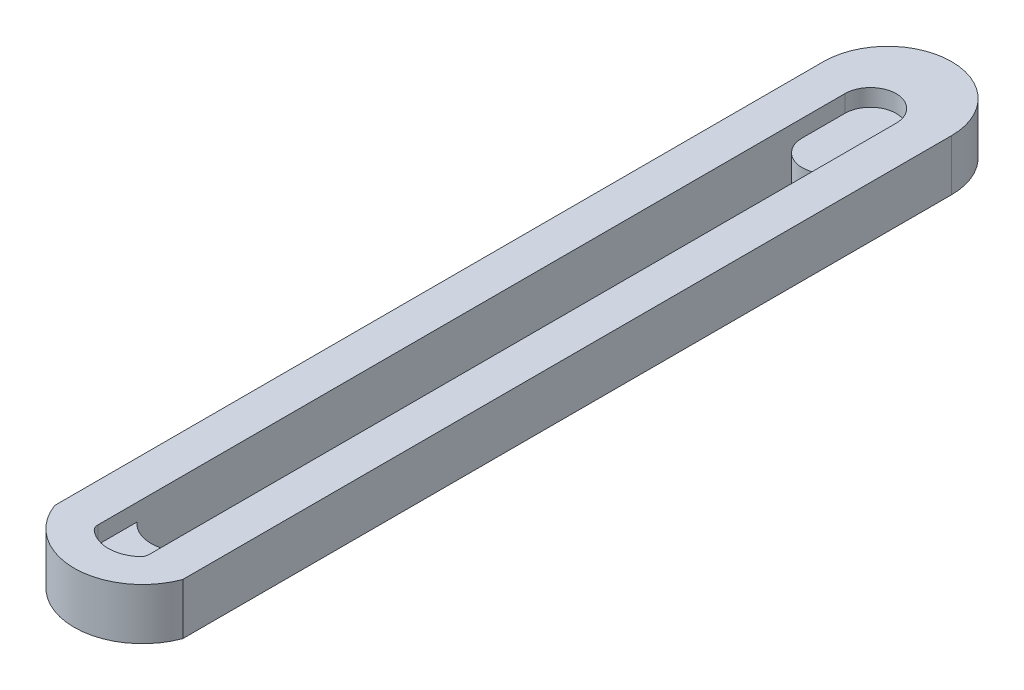
ISO-10303-21;
HEADER;
FILE_DESCRIPTION(('STEP AP214'),'2;1');
FILE_NAME('part.step','',(''),(''),'','','');
FILE_SCHEMA(('AUTOMOTIVE_DESIGN { 1 0 10303 214 1 1 1 1 }'));
ENDSEC;
DATA;
#1=APPLICATION_CONTEXT('core data for automotive mechanical design processes');
#2=APPLICATION_PROTOCOL_DEFINITION('international standard','automotive_design',2000,#1);
#3=PRODUCT_CONTEXT('',#1,'mechanical');
#4=PRODUCT('Part','Part','',(#3));
#5=PRODUCT_RELATED_PRODUCT_CATEGORY('part','',(#4));
#6=PRODUCT_DEFINITION_FORMATION('','',#4);
#7=PRODUCT_DEFINITION_CONTEXT('part definition',#1,'design');
#8=PRODUCT_DEFINITION('design','',#6,#7);
#9=PRODUCT_DEFINITION_SHAPE('','',#8);
#10=(LENGTH_UNIT() NAMED_UNIT(*) SI_UNIT(.MILLI.,.METRE.));
#11=(NAMED_UNIT(*) PLANE_ANGLE_UNIT() SI_UNIT($,.RADIAN.));
#12=(NAMED_UNIT(*) SI_UNIT($,.STERADIAN.) SOLID_ANGLE_UNIT());
#13=UNCERTAINTY_MEASURE_WITH_UNIT(LENGTH_MEASURE(1.E-05),#10,'distance_accuracy_value','');
#14=(GEOMETRIC_REPRESENTATION_CONTEXT(3) GLOBAL_UNCERTAINTY_ASSIGNED_CONTEXT((#13)) GLOBAL_UNIT_ASSIGNED_CONTEXT((#10,
#11,#12)) REPRESENTATION_CONTEXT('',''));
#15=CARTESIAN_POINT('',(0.,0.,0.));
#16=DIRECTION('',(0.,0.,1.));
#17=DIRECTION('',(1.,0.,0.));
#18=AXIS2_PLACEMENT_3D('',#15,#16,#17);
#19=CARTESIAN_POINT('',(0.,0.5,0.));
#20=DIRECTION('',(0.,1.,0.));
#21=DIRECTION('',(0.,0.,1.));
#22=AXIS2_PLACEMENT_3D('',#19,#20,#21);
#23=PLANE('',#22);
#24=CARTESIAN_POINT('',(0.,0.5,-40.1080589092925));
#25=DIRECTION('',(0.,1.,0.));
#26=DIRECTION('',(0.,0.,1.));
#27=AXIS2_PLACEMENT_3D('',#24,#25,#26);
#28=CIRCLE('',#27,1.5);
#29=CARTESIAN_POINT('',(1.5,0.5,-40.1080589092925));
#30=VERTEX_POINT('',#29);
#31=CARTESIAN_POINT('',(-1.5,0.5,-40.1080589092925));
#32=VERTEX_POINT('',#31);
#33=EDGE_CURVE('E11',#30,#32,#28,.F.);
#34=ORIENTED_EDGE('',*,*,#33,.F.);
#35=DIRECTION('',(0.,0.,1.));
#36=VECTOR('',#35,1.);
#37=CARTESIAN_POINT('',(1.5,0.5,0.));
#38=LINE('',#37,#36);
#39=CARTESIAN_POINT('',(1.5,0.5,-42.6080589092925));
#40=VERTEX_POINT('',#39);
#41=EDGE_CURVE('E195',#40,#30,#38,.T.);
#42=ORIENTED_EDGE('',*,*,#41,.F.);
#43=CARTESIAN_POINT('',(0.,0.5,-42.6080589092925));
#44=DIRECTION('',(0.,1.,0.));
#45=DIRECTION('',(0.,0.,1.));
#46=AXIS2_PLACEMENT_3D('',#43,#44,#45);
#47=CIRCLE('',#46,1.5);
#48=CARTESIAN_POINT('',(-1.5,0.5,-42.6080589092925));
#49=VERTEX_POINT('',#48);
#50=EDGE_CURVE('E184',#40,#49,#47,.T.);
#51=ORIENTED_EDGE('',*,*,#50,.T.);
#52=DIRECTION('',(0.,0.,-1.));
#53=VECTOR('',#52,1.);
#54=CARTESIAN_POINT('',(-1.5,0.5,0.));
#55=LINE('',#54,#53);
#56=EDGE_CURVE('E199',#32,#49,#55,.T.);
#57=ORIENTED_EDGE('',*,*,#56,.F.);
#58=EDGE_LOOP('',(#34,#42,#51,#57));
#59=FACE_BOUND('',#58,.T.);
#60=ADVANCED_FACE('F44',(#59),#23,.T.);
#61=CARTESIAN_POINT('',(0.,1.5,-42.6080589092925));
#62=DIRECTION('',(0.,-1.,0.));
#63=DIRECTION('',(0.,0.,-1.));
#64=AXIS2_PLACEMENT_3D('',#61,#62,#63);
#65=CYLINDRICAL_SURFACE('',#64,1.5);
#66=CARTESIAN_POINT('',(0.,-1.5,-42.6080589092925));
#67=DIRECTION('',(0.,1.,0.));
#68=DIRECTION('',(0.,0.,1.));
#69=AXIS2_PLACEMENT_3D('',#66,#67,#68);
#70=CIRCLE('',#69,1.5);
#71=CARTESIAN_POINT('',(0.,-1.5,-41.1080589092925));
#72=VERTEX_POINT('',#71);
#73=EDGE_CURVE('E216',#72,#72,#70,.T.);
#74=ORIENTED_EDGE('',*,*,#73,.F.);
#75=EDGE_LOOP('',(#74));
#76=FACE_BOUND('',#75,.T.);
#77=CARTESIAN_POINT('',(0.,0.,-42.6080589092925));
#78=DIRECTION('',(0.,1.,0.));
#79=DIRECTION('',(0.,0.,1.));
#80=AXIS2_PLACEMENT_3D('',#77,#78,#79);
#81=CIRCLE('',#80,1.5);
#82=CARTESIAN_POINT('',(0.,0.,-41.1080589092925));
#83=VERTEX_POINT('',#82);
#84=EDGE_CURVE('E174',#83,#83,#81,.T.);
#85=ORIENTED_EDGE('',*,*,#84,.T.);
#86=EDGE_LOOP('',(#85));
#87=FACE_BOUND('',#86,.T.);
#88=ADVANCED_FACE('F339',(#76,#87),#65,.F.);
#89=CARTESIAN_POINT('',(0.,1.5,0.));
#90=DIRECTION('',(0.,1.,0.));
#91=DIRECTION('',(0.,0.,1.));
#92=AXIS2_PLACEMENT_3D('',#89,#90,#91);
#93=PLANE('',#92);
#94=CARTESIAN_POINT('',(0.,1.5,0.));
#95=DIRECTION('',(0.,1.,0.));
#96=DIRECTION('',(0.,0.,1.));
#97=AXIS2_PLACEMENT_3D('',#94,#95,#96);
#98=CIRCLE('',#97,4.);
#99=CARTESIAN_POINT('',(-3.75000000000001,1.5,1.39194109070749));
#100=VERTEX_POINT('',#99);
#101=CARTESIAN_POINT('',(3.75000000000001,1.5,1.39194109070749));
#102=VERTEX_POINT('',#101);
#103=EDGE_CURVE('E228',#100,#102,#98,.T.);
#104=ORIENTED_EDGE('',*,*,#103,.T.);
#105=DIRECTION('',(0.,0.,-1.));
#106=VECTOR('',#105,1.);
#107=CARTESIAN_POINT('',(3.75,1.5,-43.6080589092925));
#108=LINE('',#107,#106);
#109=CARTESIAN_POINT('',(3.75,1.5,-43.6080589092925));
#110=VERTEX_POINT('',#109);
#111=EDGE_CURVE('E232',#102,#110,#108,.T.);
#112=ORIENTED_EDGE('',*,*,#111,.T.);
#113=CARTESIAN_POINT('',(0.,1.5,-43.6080589092925));
#114=DIRECTION('',(0.,1.,0.));
#115=DIRECTION('',(0.,0.,-1.));
#116=AXIS2_PLACEMENT_3D('',#113,#114,#115);
#117=CIRCLE('',#116,3.75);
#118=CARTESIAN_POINT('',(-3.75,1.5,-43.6080589092925));
#119=VERTEX_POINT('',#118);
#120=EDGE_CURVE('E236',#110,#119,#117,.T.);
#121=ORIENTED_EDGE('',*,*,#120,.T.);
#122=DIRECTION('',(0.,0.,1.));
#123=VECTOR('',#122,1.);
#124=CARTESIAN_POINT('',(-3.75000000000001,1.5,1.39194109070749));
#125=LINE('',#124,#123);
#126=EDGE_CURVE('E239',#119,#100,#125,.T.);
#127=ORIENTED_EDGE('',*,*,#126,.T.);
#128=EDGE_LOOP('',(#104,#112,#121,#127));
#129=FACE_BOUND('',#128,.T.);
#130=CARTESIAN_POINT('',(0.,1.5,0.));
#131=DIRECTION('',(0.,1.,0.));
#132=DIRECTION('',(0.,0.,1.));
#133=AXIS2_PLACEMENT_3D('',#130,#131,#132);
#134=CIRCLE('',#133,2.);
#135=CARTESIAN_POINT('',(-1.33333333333333,1.5,1.49071198499986));
#136=VERTEX_POINT('',#135);
#137=CARTESIAN_POINT('',(1.33333333333333,1.5,1.49071198499986));
#138=VERTEX_POINT('',#137);
#139=EDGE_CURVE('E188',#136,#138,#134,.T.);
#140=ORIENTED_EDGE('',*,*,#139,.F.);
#141=CARTESIAN_POINT('',(-0.999999999999996,1.5,1.1180339887499));
#142=DIRECTION('',(0.,1.,0.));
#143=DIRECTION('',(0.,0.,1.));
#144=AXIS2_PLACEMENT_3D('',#141,#142,#143);
#145=CIRCLE('',#144,0.5);
#146=CARTESIAN_POINT('',(-1.5,1.5,1.1180339887499));
#147=VERTEX_POINT('',#146);
#148=EDGE_CURVE('E290',#136,#147,#145,.F.);
#149=ORIENTED_EDGE('',*,*,#148,.T.);
#150=DIRECTION('',(0.,0.,-1.));
#151=VECTOR('',#150,1.);
#152=CARTESIAN_POINT('',(-1.5,1.5,0.));
#153=LINE('',#152,#151);
#154=CARTESIAN_POINT('',(-1.5,1.5,-42.6080589092925));
#155=VERTEX_POINT('',#154);
#156=EDGE_CURVE('E194',#147,#155,#153,.T.);
#157=ORIENTED_EDGE('',*,*,#156,.T.);
#158=CARTESIAN_POINT('',(0.,1.5,-42.6080589092925));
#159=DIRECTION('',(0.,1.,0.));
#160=DIRECTION('',(0.,0.,1.));
#161=AXIS2_PLACEMENT_3D('',#158,#159,#160);
#162=CIRCLE('',#161,1.5);
#163=CARTESIAN_POINT('',(1.5,1.5,-42.6080589092925));
#164=VERTEX_POINT('',#163);
#165=EDGE_CURVE('E220',#164,#155,#162,.T.);
#166=ORIENTED_EDGE('',*,*,#165,.F.);
#167=DIRECTION('',(0.,0.,1.));
#168=VECTOR('',#167,1.);
#169=CARTESIAN_POINT('',(1.5,1.5,0.));
#170=LINE('',#169,#168);
#171=CARTESIAN_POINT('',(1.5,1.5,1.1180339887499));
#172=VERTEX_POINT('',#171);
#173=EDGE_CURVE('E207',#164,#172,#170,.T.);
#174=ORIENTED_EDGE('',*,*,#173,.T.);
#175=CARTESIAN_POINT('',(0.999999999999996,1.5,1.1180339887499));
#176=DIRECTION('',(0.,1.,0.));
#177=DIRECTION('',(0.,0.,1.));
#178=AXIS2_PLACEMENT_3D('',#175,#176,#177);
#179=CIRCLE('',#178,0.5);
#180=EDGE_CURVE('E293',#172,#138,#179,.F.);
#181=ORIENTED_EDGE('',*,*,#180,.T.);
#182=EDGE_LOOP('',(#140,#149,#157,#166,#174,#181));
#183=FACE_BOUND('',#182,.T.);
#184=ADVANCED_FACE('F318',(#129,#183),#93,.T.);
#185=ORIENTED_EDGE('',*,*,#50,.F.);
#186=DIRECTION('',(0.,1.,0.));
#187=VECTOR('',#186,1.);
#188=CARTESIAN_POINT('',(1.5,0.5,-42.6080589092925));
#189=LINE('',#188,#187);
#190=EDGE_CURVE('E203',#40,#164,#189,.T.);
#191=ORIENTED_EDGE('',*,*,#190,.T.);
#192=ORIENTED_EDGE('',*,*,#165,.T.);
#193=DIRECTION('',(0.,1.,0.));
#194=VECTOR('',#193,1.);
#195=CARTESIAN_POINT('',(-1.5,0.5,-42.6080589092925));
#196=LINE('',#195,#194);
#197=EDGE_CURVE('E212',#49,#155,#196,.T.);
#198=ORIENTED_EDGE('',*,*,#197,.F.);
#199=EDGE_LOOP('',(#185,#191,#192,#198));
#200=FACE_BOUND('',#199,.T.);
#201=ADVANCED_FACE('F313',(#200),#65,.F.);
#202=CARTESIAN_POINT('',(0.,-1.5,0.));
#203=DIRECTION('',(0.,1.,0.));
#204=DIRECTION('',(0.,0.,1.));
#205=AXIS2_PLACEMENT_3D('',#202,#203,#204);
#206=PLANE('',#205);
#207=DIRECTION('',(0.,0.,-1.));
#208=VECTOR('',#207,1.);
#209=CARTESIAN_POINT('',(1.5,-1.5,-1.1771243444677));
#210=LINE('',#209,#208);
#211=CARTESIAN_POINT('',(1.5,-1.5,-1.1771243444677));
#212=VERTEX_POINT('',#211);
#213=CARTESIAN_POINT('',(1.5,-1.5,-40.1080589092925));
#214=VERTEX_POINT('',#213);
#215=EDGE_CURVE('E152',#212,#214,#210,.T.);
#216=ORIENTED_EDGE('',*,*,#215,.T.);
#217=CARTESIAN_POINT('',(0.,-1.5,-40.1080589092925));
#218=DIRECTION('',(0.,-1.,0.));
#219=DIRECTION('',(0.,0.,1.));
#220=AXIS2_PLACEMENT_3D('',#217,#218,#219);
#221=CIRCLE('',#220,1.5);
#222=CARTESIAN_POINT('',(-1.5,-1.5,-40.1080589092925));
#223=VERTEX_POINT('',#222);
#224=EDGE_CURVE('E146',#214,#223,#221,.T.);
#225=ORIENTED_EDGE('',*,*,#224,.T.);
#226=DIRECTION('',(0.,0.,1.));
#227=VECTOR('',#226,1.);
#228=CARTESIAN_POINT('',(-1.5,-1.5,-40.1080589092925));
#229=LINE('',#228,#227);
#230=CARTESIAN_POINT('',(-1.5,-1.5,-1.1771243444677));
#231=VERTEX_POINT('',#230);
#232=EDGE_CURVE('E155',#223,#231,#229,.T.);
#233=ORIENTED_EDGE('',*,*,#232,.T.);
#234=CARTESIAN_POINT('',(0.,-1.5,-2.5));
#235=DIRECTION('',(0.,1.,0.));
#236=DIRECTION('',(0.,0.,1.));
#237=AXIS2_PLACEMENT_3D('',#234,#235,#236);
#238=CIRCLE('',#237,2.);
#239=EDGE_CURVE('E60',#231,#212,#238,.T.);
#240=ORIENTED_EDGE('',*,*,#239,.T.);
#241=EDGE_LOOP('',(#216,#225,#233,#240));
#242=FACE_BOUND('',#241,.T.);
#243=CARTESIAN_POINT('',(0.,-1.5,0.));
#244=DIRECTION('',(0.,1.,0.));
#245=DIRECTION('',(0.,0.,1.));
#246=AXIS2_PLACEMENT_3D('',#243,#244,#245);
#247=CIRCLE('',#246,4.);
#248=CARTESIAN_POINT('',(-3.75000000000001,-1.5,1.39194109070749));
#249=VERTEX_POINT('',#248);
#250=CARTESIAN_POINT('',(3.75000000000001,-1.5,1.39194109070749));
#251=VERTEX_POINT('',#250);
#252=EDGE_CURVE('E224',#249,#251,#247,.T.);
#253=ORIENTED_EDGE('',*,*,#252,.F.);
#254=DIRECTION('',(0.,0.,1.));
#255=VECTOR('',#254,1.);
#256=CARTESIAN_POINT('',(-3.75000000000001,-1.5,1.39194109070749));
#257=LINE('',#256,#255);
#258=CARTESIAN_POINT('',(-3.75,-1.5,-43.6080589092925));
#259=VERTEX_POINT('',#258);
#260=EDGE_CURVE('E233',#259,#249,#257,.T.);
#261=ORIENTED_EDGE('',*,*,#260,.F.);
#262=CARTESIAN_POINT('',(0.,-1.5,-43.6080589092925));
#263=DIRECTION('',(0.,1.,0.));
#264=DIRECTION('',(0.,0.,-1.));
#265=AXIS2_PLACEMENT_3D('',#262,#263,#264);
#266=CIRCLE('',#265,3.75);
#267=CARTESIAN_POINT('',(3.75,-1.5,-43.6080589092925));
#268=VERTEX_POINT('',#267);
#269=EDGE_CURVE('E249',#268,#259,#266,.T.);
#270=ORIENTED_EDGE('',*,*,#269,.F.);
#271=DIRECTION('',(0.,0.,-1.));
#272=VECTOR('',#271,1.);
#273=CARTESIAN_POINT('',(3.75,-1.5,-43.6080589092925));
#274=LINE('',#273,#272);
#275=EDGE_CURVE('E246',#251,#268,#274,.T.);
#276=ORIENTED_EDGE('',*,*,#275,.F.);
#277=EDGE_LOOP('',(#253,#261,#270,#276));
#278=FACE_BOUND('',#277,.T.);
#279=ORIENTED_EDGE('',*,*,#73,.T.);
#280=EDGE_LOOP('',(#279));
#281=FACE_BOUND('',#280,.T.);
#282=ADVANCED_FACE('F161',(#242,#278,#281),#206,.F.);
#283=CARTESIAN_POINT('',(0.,1.5,0.));
#284=DIRECTION('',(0.,-1.,0.));
#285=DIRECTION('',(0.,0.,-1.));
#286=AXIS2_PLACEMENT_3D('',#283,#284,#285);
#287=CYLINDRICAL_SURFACE('',#286,4.);
#288=ORIENTED_EDGE('',*,*,#252,.T.);
#289=DIRECTION('',(0.,-1.,0.));
#290=VECTOR('',#289,1.);
#291=CARTESIAN_POINT('',(3.75000000000001,1.5,1.39194109070749));
#292=LINE('',#291,#290);
#293=EDGE_CURVE('E265',#102,#251,#292,.T.);
#294=ORIENTED_EDGE('',*,*,#293,.F.);
#295=ORIENTED_EDGE('',*,*,#103,.F.);
#296=DIRECTION('',(0.,-1.,0.));
#297=VECTOR('',#296,1.);
#298=CARTESIAN_POINT('',(-3.75000000000001,1.5,1.39194109070749));
#299=LINE('',#298,#297);
#300=EDGE_CURVE('E242',#100,#249,#299,.T.);
#301=ORIENTED_EDGE('',*,*,#300,.T.);
#302=EDGE_LOOP('',(#288,#294,#295,#301));
#303=FACE_BOUND('',#302,.T.);
#304=ADVANCED_FACE('F365',(#303),#287,.T.);
#305=CARTESIAN_POINT('',(3.75,1.5,-43.6080589092925));
#306=DIRECTION('',(-1.,0.,0.));
#307=DIRECTION('',(0.,0.,1.));
#308=AXIS2_PLACEMENT_3D('',#305,#306,#307);
#309=PLANE('',#308);
#310=ORIENTED_EDGE('',*,*,#275,.T.);
#311=DIRECTION('',(0.,-1.,0.));
#312=VECTOR('',#311,1.);
#313=CARTESIAN_POINT('',(3.75,1.5,-43.6080589092925));
#314=LINE('',#313,#312);
#315=EDGE_CURVE('E261',#110,#268,#314,.T.);
#316=ORIENTED_EDGE('',*,*,#315,.F.);
#317=ORIENTED_EDGE('',*,*,#111,.F.);
#318=ORIENTED_EDGE('',*,*,#293,.T.);
#319=EDGE_LOOP('',(#310,#316,#317,#318));
#320=FACE_BOUND('',#319,.T.);
#321=ADVANCED_FACE('F372',(#320),#309,.F.);
#322=CARTESIAN_POINT('',(0.,1.5,-43.6080589092925));
#323=DIRECTION('',(0.,-1.,0.));
#324=DIRECTION('',(0.,0.,-1.));
#325=AXIS2_PLACEMENT_3D('',#322,#323,#324);
#326=CYLINDRICAL_SURFACE('',#325,3.75);
#327=ORIENTED_EDGE('',*,*,#269,.T.);
#328=DIRECTION('',(0.,-1.,0.));
#329=VECTOR('',#328,1.);
#330=CARTESIAN_POINT('',(-3.75,1.5,-43.6080589092925));
#331=LINE('',#330,#329);
#332=EDGE_CURVE('E257',#119,#259,#331,.T.);
#333=ORIENTED_EDGE('',*,*,#332,.F.);
#334=ORIENTED_EDGE('',*,*,#120,.F.);
#335=ORIENTED_EDGE('',*,*,#315,.T.);
#336=EDGE_LOOP('',(#327,#333,#334,#335));
#337=FACE_BOUND('',#336,.T.);
#338=ADVANCED_FACE('F368',(#337),#326,.T.);
#339=CARTESIAN_POINT('',(-3.75000000000001,1.5,1.39194109070749));
#340=DIRECTION('',(1.,0.,0.));
#341=DIRECTION('',(0.,0.,-1.));
#342=AXIS2_PLACEMENT_3D('',#339,#340,#341);
#343=PLANE('',#342);
#344=ORIENTED_EDGE('',*,*,#260,.T.);
#345=ORIENTED_EDGE('',*,*,#300,.F.);
#346=ORIENTED_EDGE('',*,*,#126,.F.);
#347=ORIENTED_EDGE('',*,*,#332,.T.);
#348=EDGE_LOOP('',(#344,#345,#346,#347));
#349=FACE_BOUND('',#348,.T.);
#350=ADVANCED_FACE('F357',(#349),#343,.F.);
#351=CARTESIAN_POINT('',(0.,0.5,0.));
#352=DIRECTION('',(0.,1.,0.));
#353=DIRECTION('',(0.,0.,1.));
#354=AXIS2_PLACEMENT_3D('',#351,#352,#353);
#355=CYLINDRICAL_SURFACE('',#354,2.);
#356=CARTESIAN_POINT('',(0.,0.5,0.));
#357=DIRECTION('',(0.,1.,0.));
#358=DIRECTION('',(0.,0.,1.));
#359=AXIS2_PLACEMENT_3D('',#356,#357,#358);
#360=CIRCLE('',#359,2.);
#361=CARTESIAN_POINT('',(-1.33333333333333,0.5,1.49071198499986));
#362=VERTEX_POINT('',#361);
#363=CARTESIAN_POINT('',(1.33333333333333,0.5,1.49071198499986));
#364=VERTEX_POINT('',#363);
#365=EDGE_CURVE('E189',#362,#364,#360,.T.);
#366=ORIENTED_EDGE('',*,*,#365,.F.);
#367=DIRECTION('',(0.,1.,0.));
#368=VECTOR('',#367,1.);
#369=CARTESIAN_POINT('',(-1.33333333333333,0.5,1.49071198499986));
#370=LINE('',#369,#368);
#371=EDGE_CURVE('E272',#362,#136,#370,.T.);
#372=ORIENTED_EDGE('',*,*,#371,.T.);
#373=ORIENTED_EDGE('',*,*,#139,.T.);
#374=DIRECTION('',(0.,1.,0.));
#375=VECTOR('',#374,1.);
#376=CARTESIAN_POINT('',(1.33333333333333,0.5,1.49071198499986));
#377=LINE('',#376,#375);
#378=EDGE_CURVE('E269',#138,#364,#377,.F.);
#379=ORIENTED_EDGE('',*,*,#378,.T.);
#380=EDGE_LOOP('',(#366,#372,#373,#379));
#381=FACE_BOUND('',#380,.T.);
#382=ADVANCED_FACE('F327',(#381),#355,.F.);
#383=CARTESIAN_POINT('',(-1.5,0.5,0.));
#384=DIRECTION('',(1.,0.,0.));
#385=DIRECTION('',(0.,0.,-1.));
#386=AXIS2_PLACEMENT_3D('',#383,#384,#385);
#387=PLANE('',#386);
#388=CARTESIAN_POINT('',(-1.5,0.5,1.1180339887499));
#389=VERTEX_POINT('',#388);
#390=CARTESIAN_POINT('',(-1.5,0.5,-1.1771243444677));
#391=VERTEX_POINT('',#390);
#392=EDGE_CURVE('E200',#389,#391,#55,.T.);
#393=ORIENTED_EDGE('',*,*,#392,.T.);
#394=DIRECTION('',(0.,1.,0.));
#395=VECTOR('',#394,1.);
#396=CARTESIAN_POINT('',(-1.5,-1.5,-1.1771243444677));
#397=LINE('',#396,#395);
#398=EDGE_CURVE('E151',#231,#391,#397,.T.);
#399=ORIENTED_EDGE('',*,*,#398,.F.);
#400=ORIENTED_EDGE('',*,*,#232,.F.);
#401=DIRECTION('',(0.,1.,0.));
#402=VECTOR('',#401,1.);
#403=CARTESIAN_POINT('',(-1.5,-1.5,-40.1080589092925));
#404=LINE('',#403,#402);
#405=EDGE_CURVE('E68',#223,#32,#404,.T.);
#406=ORIENTED_EDGE('',*,*,#405,.T.);
#407=ORIENTED_EDGE('',*,*,#56,.T.);
#408=ORIENTED_EDGE('',*,*,#197,.T.);
#409=ORIENTED_EDGE('',*,*,#156,.F.);
#410=DIRECTION('',(0.,1.,0.));
#411=VECTOR('',#410,1.);
#412=CARTESIAN_POINT('',(-1.5,0.5,1.1180339887499));
#413=LINE('',#412,#411);
#414=EDGE_CURVE('E276',#147,#389,#413,.F.);
#415=ORIENTED_EDGE('',*,*,#414,.T.);
#416=EDGE_LOOP('',(#393,#399,#400,#406,#407,#408,#409,#415));
#417=FACE_BOUND('',#416,.T.);
#418=ADVANCED_FACE('F157',(#417),#387,.T.);
#419=CARTESIAN_POINT('',(1.5,0.5,0.));
#420=DIRECTION('',(-1.,0.,0.));
#421=DIRECTION('',(0.,0.,1.));
#422=AXIS2_PLACEMENT_3D('',#419,#420,#421);
#423=PLANE('',#422);
#424=DIRECTION('',(0.,1.,0.));
#425=VECTOR('',#424,1.);
#426=CARTESIAN_POINT('',(1.5,0.5,1.1180339887499));
#427=LINE('',#426,#425);
#428=CARTESIAN_POINT('',(1.5,0.5,1.1180339887499));
#429=VERTEX_POINT('',#428);
#430=EDGE_CURVE('E286',#429,#172,#427,.T.);
#431=ORIENTED_EDGE('',*,*,#430,.T.);
#432=ORIENTED_EDGE('',*,*,#173,.F.);
#433=ORIENTED_EDGE('',*,*,#190,.F.);
#434=ORIENTED_EDGE('',*,*,#41,.T.);
#435=DIRECTION('',(0.,1.,0.));
#436=VECTOR('',#435,1.);
#437=CARTESIAN_POINT('',(1.5,-1.5,-40.1080589092925));
#438=LINE('',#437,#436);
#439=EDGE_CURVE('E171',#214,#30,#438,.T.);
#440=ORIENTED_EDGE('',*,*,#439,.F.);
#441=ORIENTED_EDGE('',*,*,#215,.F.);
#442=DIRECTION('',(0.,1.,0.));
#443=VECTOR('',#442,1.);
#444=CARTESIAN_POINT('',(1.5,-1.5,-1.1771243444677));
#445=LINE('',#444,#443);
#446=CARTESIAN_POINT('',(1.5,0.5,-1.1771243444677));
#447=VERTEX_POINT('',#446);
#448=EDGE_CURVE('E175',#212,#447,#445,.T.);
#449=ORIENTED_EDGE('',*,*,#448,.T.);
#450=EDGE_CURVE('E193',#447,#429,#38,.T.);
#451=ORIENTED_EDGE('',*,*,#450,.T.);
#452=EDGE_LOOP('',(#431,#432,#433,#434,#440,#441,#449,#451));
#453=FACE_BOUND('',#452,.T.);
#454=ADVANCED_FACE('F302',(#453),#423,.T.);
#455=CARTESIAN_POINT('',(0.,0.5,-2.5));
#456=DIRECTION('',(0.,1.,0.));
#457=DIRECTION('',(0.,0.,1.));
#458=AXIS2_PLACEMENT_3D('',#455,#456,#457);
#459=CIRCLE('',#458,2.);
#460=EDGE_CURVE('E53',#391,#447,#459,.T.);
#461=ORIENTED_EDGE('',*,*,#460,.F.);
#462=ORIENTED_EDGE('',*,*,#392,.F.);
#463=CARTESIAN_POINT('',(-0.999999999999996,0.5,1.1180339887499));
#464=DIRECTION('',(0.,1.,0.));
#465=DIRECTION('',(0.,0.,1.));
#466=AXIS2_PLACEMENT_3D('',#463,#464,#465);
#467=CIRCLE('',#466,0.5);
#468=EDGE_CURVE('E283',#389,#362,#467,.T.);
#469=ORIENTED_EDGE('',*,*,#468,.T.);
#470=ORIENTED_EDGE('',*,*,#365,.T.);
#471=CARTESIAN_POINT('',(0.999999999999996,0.5,1.1180339887499));
#472=DIRECTION('',(0.,1.,0.));
#473=DIRECTION('',(0.,0.,1.));
#474=AXIS2_PLACEMENT_3D('',#471,#472,#473);
#475=CIRCLE('',#474,0.5);
#476=EDGE_CURVE('E279',#364,#429,#475,.T.);
#477=ORIENTED_EDGE('',*,*,#476,.T.);
#478=ORIENTED_EDGE('',*,*,#450,.F.);
#479=EDGE_LOOP('',(#461,#462,#469,#470,#477,#478));
#480=FACE_BOUND('',#479,.T.);
#481=ADVANCED_FACE('F303',(#480),#23,.T.);
#482=CARTESIAN_POINT('',(-0.999999999999996,0.5,1.1180339887499));
#483=DIRECTION('',(0.,1.,0.));
#484=DIRECTION('',(0.,0.,1.));
#485=AXIS2_PLACEMENT_3D('',#482,#483,#484);
#486=CYLINDRICAL_SURFACE('',#485,0.5);
#487=ORIENTED_EDGE('',*,*,#468,.F.);
#488=ORIENTED_EDGE('',*,*,#414,.F.);
#489=ORIENTED_EDGE('',*,*,#148,.F.);
#490=ORIENTED_EDGE('',*,*,#371,.F.);
#491=EDGE_LOOP('',(#487,#488,#489,#490));
#492=FACE_BOUND('',#491,.T.);
#493=ADVANCED_FACE('F323',(#492),#486,.F.);
#494=CARTESIAN_POINT('',(0.999999999999996,0.5,1.1180339887499));
#495=DIRECTION('',(0.,1.,0.));
#496=DIRECTION('',(0.,0.,1.));
#497=AXIS2_PLACEMENT_3D('',#494,#495,#496);
#498=CYLINDRICAL_SURFACE('',#497,0.5);
#499=ORIENTED_EDGE('',*,*,#476,.F.);
#500=ORIENTED_EDGE('',*,*,#378,.F.);
#501=ORIENTED_EDGE('',*,*,#180,.F.);
#502=ORIENTED_EDGE('',*,*,#430,.F.);
#503=EDGE_LOOP('',(#499,#500,#501,#502));
#504=FACE_BOUND('',#503,.T.);
#505=ADVANCED_FACE('F46',(#504),#498,.F.);
#506=CARTESIAN_POINT('',(0.,0.,-42.6080589092925));
#507=DIRECTION('',(0.,1.,0.));
#508=DIRECTION('',(0.,0.,1.));
#509=AXIS2_PLACEMENT_3D('',#506,#507,#508);
#510=PLANE('',#509);
#511=ORIENTED_EDGE('',*,*,#84,.F.);
#512=EDGE_LOOP('',(#511));
#513=FACE_BOUND('',#512,.T.);
#514=ADVANCED_FACE('F331',(#513),#510,.F.);
#515=CARTESIAN_POINT('',(0.,-1.5,-40.1080589092925));
#516=DIRECTION('',(0.,1.,0.));
#517=DIRECTION('',(0.,0.,1.));
#518=AXIS2_PLACEMENT_3D('',#515,#516,#517);
#519=CYLINDRICAL_SURFACE('',#518,1.5);
#520=ORIENTED_EDGE('',*,*,#33,.T.);
#521=ORIENTED_EDGE('',*,*,#405,.F.);
#522=ORIENTED_EDGE('',*,*,#224,.F.);
#523=ORIENTED_EDGE('',*,*,#439,.T.);
#524=EDGE_LOOP('',(#520,#521,#522,#523));
#525=FACE_BOUND('',#524,.T.);
#526=ADVANCED_FACE('F144',(#525),#519,.T.);
#527=CARTESIAN_POINT('',(0.,-1.5,-2.5));
#528=DIRECTION('',(0.,1.,0.));
#529=DIRECTION('',(0.,0.,1.));
#530=AXIS2_PLACEMENT_3D('',#527,#528,#529);
#531=CYLINDRICAL_SURFACE('',#530,2.);
#532=ORIENTED_EDGE('',*,*,#460,.T.);
#533=ORIENTED_EDGE('',*,*,#448,.F.);
#534=ORIENTED_EDGE('',*,*,#239,.F.);
#535=ORIENTED_EDGE('',*,*,#398,.T.);
#536=EDGE_LOOP('',(#532,#533,#534,#535));
#537=FACE_BOUND('',#536,.T.);
#538=ADVANCED_FACE('F297',(#537),#531,.F.);
#539=CLOSED_SHELL('',(#60,#88,#184,#201,#282,#304,#321,#338,#350,#382,#418,#454,#481,#493,#505,
#514,#526,#538));
#540=MANIFOLD_SOLID_BREP('B2',#539);
#541=ADVANCED_BREP_SHAPE_REPRESENTATION('',(#18,#540),#14);
#542=SHAPE_DEFINITION_REPRESENTATION(#9,#541);
ENDSEC;
END-ISO-10303-21;
